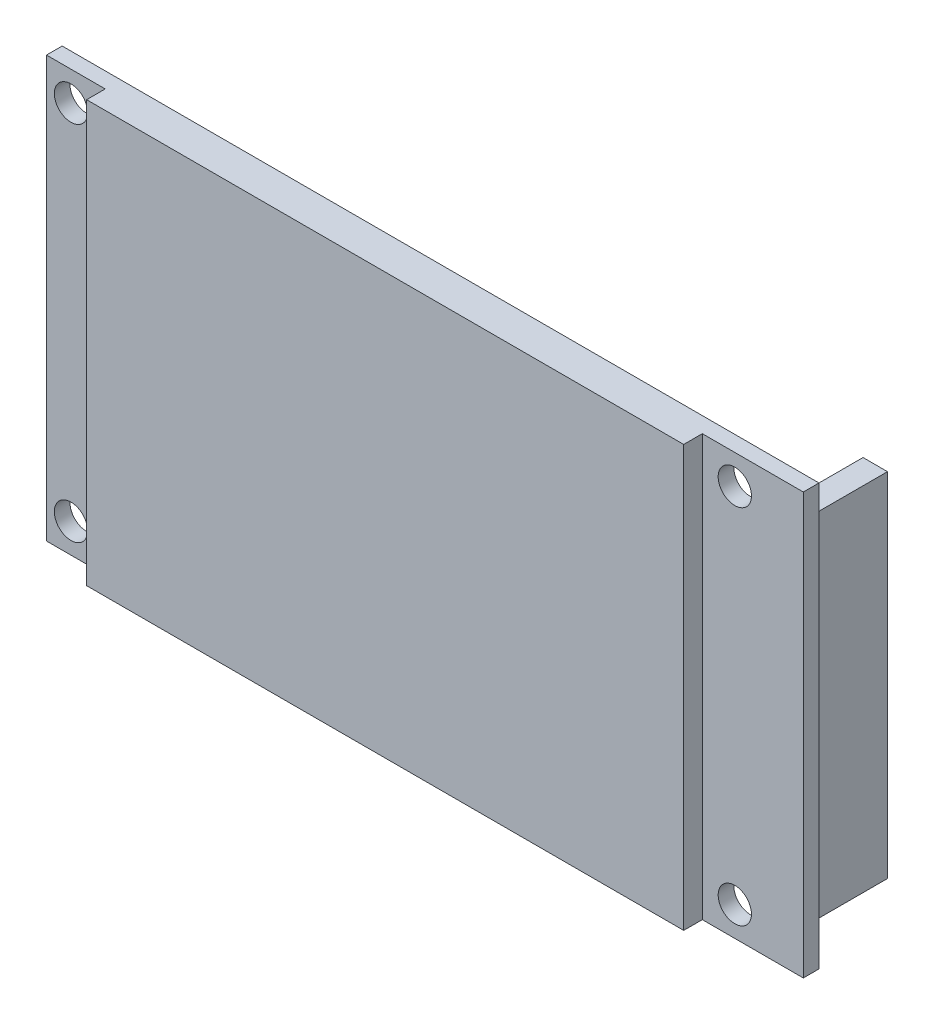
ISO-10303-21;
HEADER;
FILE_DESCRIPTION(('STEP AP214'),'2;1');
FILE_NAME('part.step','',(''),(''),'','','');
FILE_SCHEMA(('AUTOMOTIVE_DESIGN { 1 0 10303 214 1 1 1 1 }'));
ENDSEC;
DATA;
#1=APPLICATION_CONTEXT('core data for automotive mechanical design processes');
#2=APPLICATION_PROTOCOL_DEFINITION('international standard','automotive_design',2000,#1);
#3=PRODUCT_CONTEXT('',#1,'mechanical');
#4=PRODUCT('Part','Part','',(#3));
#5=PRODUCT_RELATED_PRODUCT_CATEGORY('part','',(#4));
#6=PRODUCT_DEFINITION_FORMATION('','',#4);
#7=PRODUCT_DEFINITION_CONTEXT('part definition',#1,'design');
#8=PRODUCT_DEFINITION('design','',#6,#7);
#9=PRODUCT_DEFINITION_SHAPE('','',#8);
#10=(LENGTH_UNIT() NAMED_UNIT(*) SI_UNIT(.MILLI.,.METRE.));
#11=(NAMED_UNIT(*) PLANE_ANGLE_UNIT() SI_UNIT($,.RADIAN.));
#12=(NAMED_UNIT(*) SI_UNIT($,.STERADIAN.) SOLID_ANGLE_UNIT());
#13=UNCERTAINTY_MEASURE_WITH_UNIT(LENGTH_MEASURE(1.E-05),#10,'distance_accuracy_value','');
#14=(GEOMETRIC_REPRESENTATION_CONTEXT(3) GLOBAL_UNCERTAINTY_ASSIGNED_CONTEXT((#13)) GLOBAL_UNIT_ASSIGNED_CONTEXT((#10,
#11,#12)) REPRESENTATION_CONTEXT('',''));
#15=CARTESIAN_POINT('',(0.,0.,0.));
#16=DIRECTION('',(0.,0.,1.));
#17=DIRECTION('',(1.,0.,0.));
#18=AXIS2_PLACEMENT_3D('',#15,#16,#17);
#19=CARTESIAN_POINT('',(0.,0.,0.));
#20=DIRECTION('',(0.,0.,-1.));
#21=DIRECTION('',(-1.,0.,0.));
#22=AXIS2_PLACEMENT_3D('',#19,#20,#21);
#23=PLANE('',#22);
#24=DIRECTION('',(0.,1.,0.));
#25=VECTOR('',#24,1.);
#26=CARTESIAN_POINT('',(77.32,0.,0.));
#27=LINE('',#26,#25);
#28=CARTESIAN_POINT('',(77.32,0.,0.));
#29=VERTEX_POINT('',#28);
#30=CARTESIAN_POINT('',(77.32,43.,0.));
#31=VERTEX_POINT('',#30);
#32=EDGE_CURVE('E276',#29,#31,#27,.T.);
#33=ORIENTED_EDGE('',*,*,#32,.F.);
#34=DIRECTION('',(1.,0.,0.));
#35=VECTOR('',#34,1.);
#36=CARTESIAN_POINT('',(0.,0.,0.));
#37=LINE('',#36,#35);
#38=CARTESIAN_POINT('',(0.,0.,0.));
#39=VERTEX_POINT('',#38);
#40=EDGE_CURVE('E274',#39,#29,#37,.T.);
#41=ORIENTED_EDGE('',*,*,#40,.F.);
#42=DIRECTION('',(0.,-1.,0.));
#43=VECTOR('',#42,1.);
#44=CARTESIAN_POINT('',(0.,0.,0.));
#45=LINE('',#44,#43);
#46=CARTESIAN_POINT('',(0.,43.,0.));
#47=VERTEX_POINT('',#46);
#48=EDGE_CURVE('E256',#47,#39,#45,.T.);
#49=ORIENTED_EDGE('',*,*,#48,.F.);
#50=DIRECTION('',(-1.,0.,0.));
#51=VECTOR('',#50,1.);
#52=CARTESIAN_POINT('',(0.,43.,0.));
#53=LINE('',#52,#51);
#54=EDGE_CURVE('E263',#31,#47,#53,.T.);
#55=ORIENTED_EDGE('',*,*,#54,.F.);
#56=EDGE_LOOP('',(#33,#41,#49,#55));
#57=FACE_BOUND('',#56,.T.);
#58=CARTESIAN_POINT('',(70.32,40.,0.));
#59=DIRECTION('',(0.,0.,1.));
#60=DIRECTION('',(1.,0.,0.));
#61=AXIS2_PLACEMENT_3D('',#58,#59,#60);
#62=CIRCLE('',#61,1.7);
#63=CARTESIAN_POINT('',(72.02,40.,0.));
#64=VERTEX_POINT('',#63);
#65=EDGE_CURVE('E250',#64,#64,#62,.T.);
#66=ORIENTED_EDGE('',*,*,#65,.T.);
#67=EDGE_LOOP('',(#66));
#68=FACE_BOUND('',#67,.T.);
#69=CARTESIAN_POINT('',(70.32,3.,0.));
#70=DIRECTION('',(0.,0.,1.));
#71=DIRECTION('',(1.,0.,0.));
#72=AXIS2_PLACEMENT_3D('',#69,#70,#71);
#73=CIRCLE('',#72,1.7);
#74=CARTESIAN_POINT('',(72.02,3.,0.));
#75=VERTEX_POINT('',#74);
#76=EDGE_CURVE('E244',#75,#75,#73,.T.);
#77=ORIENTED_EDGE('',*,*,#76,.T.);
#78=EDGE_LOOP('',(#77));
#79=FACE_BOUND('',#78,.T.);
#80=CARTESIAN_POINT('',(2.5,40.,0.));
#81=DIRECTION('',(0.,0.,1.));
#82=DIRECTION('',(1.,0.,0.));
#83=AXIS2_PLACEMENT_3D('',#80,#81,#82);
#84=CIRCLE('',#83,1.7);
#85=CARTESIAN_POINT('',(4.2,40.,0.));
#86=VERTEX_POINT('',#85);
#87=EDGE_CURVE('E234',#86,#86,#84,.T.);
#88=ORIENTED_EDGE('',*,*,#87,.T.);
#89=EDGE_LOOP('',(#88));
#90=FACE_BOUND('',#89,.T.);
#91=CARTESIAN_POINT('',(2.5,3.,0.));
#92=DIRECTION('',(0.,0.,1.));
#93=DIRECTION('',(1.,0.,0.));
#94=AXIS2_PLACEMENT_3D('',#91,#92,#93);
#95=CIRCLE('',#94,1.7);
#96=CARTESIAN_POINT('',(4.2,3.,0.));
#97=VERTEX_POINT('',#96);
#98=EDGE_CURVE('E238',#97,#97,#95,.T.);
#99=ORIENTED_EDGE('',*,*,#98,.T.);
#100=EDGE_LOOP('',(#99));
#101=FACE_BOUND('',#100,.T.);
#102=DIRECTION('',(-1.,0.,0.));
#103=VECTOR('',#102,1.);
#104=CARTESIAN_POINT('',(76.32,3.49999999999999,0.));
#105=LINE('',#104,#103);
#106=CARTESIAN_POINT('',(76.32,3.49999999999999,0.));
#107=VERTEX_POINT('',#106);
#108=CARTESIAN_POINT('',(73.82,3.49999999999999,0.));
#109=VERTEX_POINT('',#108);
#110=EDGE_CURVE('E177',#107,#109,#105,.T.);
#111=ORIENTED_EDGE('',*,*,#110,.F.);
#112=DIRECTION('',(0.,-1.,0.));
#113=VECTOR('',#112,1.);
#114=CARTESIAN_POINT('',(76.32,39.5,0.));
#115=LINE('',#114,#113);
#116=CARTESIAN_POINT('',(76.32,39.5,0.));
#117=VERTEX_POINT('',#116);
#118=EDGE_CURVE('E174',#117,#107,#115,.T.);
#119=ORIENTED_EDGE('',*,*,#118,.F.);
#120=DIRECTION('',(1.,0.,0.));
#121=VECTOR('',#120,1.);
#122=CARTESIAN_POINT('',(76.32,39.5,0.));
#123=LINE('',#122,#121);
#124=CARTESIAN_POINT('',(73.82,39.5,0.));
#125=VERTEX_POINT('',#124);
#126=EDGE_CURVE('E186',#125,#117,#123,.T.);
#127=ORIENTED_EDGE('',*,*,#126,.F.);
#128=DIRECTION('',(0.,1.,0.));
#129=VECTOR('',#128,1.);
#130=CARTESIAN_POINT('',(73.82,39.5,0.));
#131=LINE('',#130,#129);
#132=EDGE_CURVE('E194',#109,#125,#131,.T.);
#133=ORIENTED_EDGE('',*,*,#132,.F.);
#134=EDGE_LOOP('',(#111,#119,#127,#133));
#135=FACE_BOUND('',#134,.T.);
#136=DIRECTION('',(-1.,0.,0.));
#137=VECTOR('',#136,1.);
#138=CARTESIAN_POINT('',(3.5,16.,0.));
#139=LINE('',#138,#137);
#140=CARTESIAN_POINT('',(3.5,16.,0.));
#141=VERTEX_POINT('',#140);
#142=CARTESIAN_POINT('',(0.999999999999999,16.,0.));
#143=VERTEX_POINT('',#142);
#144=EDGE_CURVE('E347',#141,#143,#139,.T.);
#145=ORIENTED_EDGE('',*,*,#144,.F.);
#146=DIRECTION('',(0.,-1.,0.));
#147=VECTOR('',#146,1.);
#148=CARTESIAN_POINT('',(3.5,27.,0.));
#149=LINE('',#148,#147);
#150=CARTESIAN_POINT('',(3.5,27.,0.));
#151=VERTEX_POINT('',#150);
#152=EDGE_CURVE('E172',#151,#141,#149,.T.);
#153=ORIENTED_EDGE('',*,*,#152,.F.);
#154=DIRECTION('',(1.,0.,0.));
#155=VECTOR('',#154,1.);
#156=CARTESIAN_POINT('',(3.5,27.,0.));
#157=LINE('',#156,#155);
#158=CARTESIAN_POINT('',(1.,27.,0.));
#159=VERTEX_POINT('',#158);
#160=EDGE_CURVE('E168',#159,#151,#157,.T.);
#161=ORIENTED_EDGE('',*,*,#160,.F.);
#162=DIRECTION('',(0.,1.,0.));
#163=VECTOR('',#162,1.);
#164=CARTESIAN_POINT('',(1.,27.,0.));
#165=LINE('',#164,#163);
#166=EDGE_CURVE('E349',#143,#159,#165,.T.);
#167=ORIENTED_EDGE('',*,*,#166,.F.);
#168=EDGE_LOOP('',(#145,#153,#161,#167));
#169=FACE_BOUND('',#168,.T.);
#170=ADVANCED_FACE('F35',(#57,#68,#79,#90,#101,#135,#169),#23,.T.);
#171=CARTESIAN_POINT('',(0.,0.,1.6));
#172=DIRECTION('',(0.,0.,-1.));
#173=DIRECTION('',(-1.,0.,0.));
#174=AXIS2_PLACEMENT_3D('',#171,#172,#173);
#175=PLANE('',#174);
#176=CARTESIAN_POINT('',(2.5,40.,1.6));
#177=DIRECTION('',(0.,0.,1.));
#178=DIRECTION('',(1.,0.,0.));
#179=AXIS2_PLACEMENT_3D('',#176,#177,#178);
#180=CIRCLE('',#179,1.7);
#181=CARTESIAN_POINT('',(4.2,40.,1.6));
#182=VERTEX_POINT('',#181);
#183=EDGE_CURVE('E235',#182,#182,#180,.T.);
#184=ORIENTED_EDGE('',*,*,#183,.F.);
#185=EDGE_LOOP('',(#184));
#186=FACE_BOUND('',#185,.T.);
#187=CARTESIAN_POINT('',(2.5,3.,1.6));
#188=DIRECTION('',(0.,0.,1.));
#189=DIRECTION('',(1.,0.,0.));
#190=AXIS2_PLACEMENT_3D('',#187,#188,#189);
#191=CIRCLE('',#190,1.7);
#192=CARTESIAN_POINT('',(4.2,3.,1.6));
#193=VERTEX_POINT('',#192);
#194=EDGE_CURVE('E241',#193,#193,#191,.T.);
#195=ORIENTED_EDGE('',*,*,#194,.F.);
#196=EDGE_LOOP('',(#195));
#197=FACE_BOUND('',#196,.T.);
#198=DIRECTION('',(1.,0.,0.));
#199=VECTOR('',#198,1.);
#200=CARTESIAN_POINT('',(0.,0.,1.6));
#201=LINE('',#200,#199);
#202=CARTESIAN_POINT('',(0.,0.,1.6));
#203=VERTEX_POINT('',#202);
#204=CARTESIAN_POINT('',(6.,0.,1.6));
#205=VERTEX_POINT('',#204);
#206=EDGE_CURVE('E264',#203,#205,#201,.T.);
#207=ORIENTED_EDGE('',*,*,#206,.T.);
#208=DIRECTION('',(0.,1.,0.));
#209=VECTOR('',#208,1.);
#210=CARTESIAN_POINT('',(6.,0.,1.6));
#211=LINE('',#210,#209);
#212=CARTESIAN_POINT('',(6.,43.,1.6));
#213=VERTEX_POINT('',#212);
#214=EDGE_CURVE('E231',#205,#213,#211,.T.);
#215=ORIENTED_EDGE('',*,*,#214,.T.);
#216=DIRECTION('',(-1.,0.,0.));
#217=VECTOR('',#216,1.);
#218=CARTESIAN_POINT('',(0.,43.,1.6));
#219=LINE('',#218,#217);
#220=CARTESIAN_POINT('',(0.,43.,1.6));
#221=VERTEX_POINT('',#220);
#222=EDGE_CURVE('E268',#213,#221,#219,.T.);
#223=ORIENTED_EDGE('',*,*,#222,.T.);
#224=DIRECTION('',(0.,-1.,0.));
#225=VECTOR('',#224,1.);
#226=CARTESIAN_POINT('',(0.,0.,1.6));
#227=LINE('',#226,#225);
#228=EDGE_CURVE('E259',#221,#203,#227,.T.);
#229=ORIENTED_EDGE('',*,*,#228,.T.);
#230=EDGE_LOOP('',(#207,#215,#223,#229));
#231=FACE_BOUND('',#230,.T.);
#232=ADVANCED_FACE('F304',(#186,#197,#231),#175,.F.);
#233=CARTESIAN_POINT('',(77.32,43.,1.6));
#234=VERTEX_POINT('',#233);
#235=CARTESIAN_POINT('',(67.,43.,1.6));
#236=VERTEX_POINT('',#235);
#237=EDGE_CURVE('E269',#234,#236,#219,.T.);
#238=ORIENTED_EDGE('',*,*,#237,.T.);
#239=DIRECTION('',(0.,-1.,0.));
#240=VECTOR('',#239,1.);
#241=CARTESIAN_POINT('',(67.,0.,1.6));
#242=LINE('',#241,#240);
#243=CARTESIAN_POINT('',(67.,0.,1.6));
#244=VERTEX_POINT('',#243);
#245=EDGE_CURVE('E221',#236,#244,#242,.T.);
#246=ORIENTED_EDGE('',*,*,#245,.T.);
#247=CARTESIAN_POINT('',(77.32,0.,1.6));
#248=VERTEX_POINT('',#247);
#249=EDGE_CURVE('E262',#244,#248,#201,.T.);
#250=ORIENTED_EDGE('',*,*,#249,.T.);
#251=DIRECTION('',(0.,1.,0.));
#252=VECTOR('',#251,1.);
#253=CARTESIAN_POINT('',(77.32,0.,1.6));
#254=LINE('',#253,#252);
#255=EDGE_CURVE('E266',#248,#234,#254,.T.);
#256=ORIENTED_EDGE('',*,*,#255,.T.);
#257=EDGE_LOOP('',(#238,#246,#250,#256));
#258=FACE_BOUND('',#257,.T.);
#259=CARTESIAN_POINT('',(70.32,40.,1.6));
#260=DIRECTION('',(0.,0.,1.));
#261=DIRECTION('',(1.,0.,0.));
#262=AXIS2_PLACEMENT_3D('',#259,#260,#261);
#263=CIRCLE('',#262,1.7);
#264=CARTESIAN_POINT('',(72.02,40.,1.6));
#265=VERTEX_POINT('',#264);
#266=EDGE_CURVE('E253',#265,#265,#263,.T.);
#267=ORIENTED_EDGE('',*,*,#266,.F.);
#268=EDGE_LOOP('',(#267));
#269=FACE_BOUND('',#268,.T.);
#270=CARTESIAN_POINT('',(70.32,3.,1.6));
#271=DIRECTION('',(0.,0.,1.));
#272=DIRECTION('',(1.,0.,0.));
#273=AXIS2_PLACEMENT_3D('',#270,#271,#272);
#274=CIRCLE('',#273,1.7);
#275=CARTESIAN_POINT('',(72.02,3.,1.6));
#276=VERTEX_POINT('',#275);
#277=EDGE_CURVE('E247',#276,#276,#274,.T.);
#278=ORIENTED_EDGE('',*,*,#277,.F.);
#279=EDGE_LOOP('',(#278));
#280=FACE_BOUND('',#279,.T.);
#281=ADVANCED_FACE('F319',(#258,#269,#280),#175,.F.);
#282=CARTESIAN_POINT('',(0.,0.,1.6));
#283=DIRECTION('',(1.,0.,0.));
#284=DIRECTION('',(0.,0.,-1.));
#285=AXIS2_PLACEMENT_3D('',#282,#283,#284);
#286=PLANE('',#285);
#287=ORIENTED_EDGE('',*,*,#48,.T.);
#288=DIRECTION('',(0.,0.,-1.));
#289=VECTOR('',#288,1.);
#290=CARTESIAN_POINT('',(0.,0.,1.6));
#291=LINE('',#290,#289);
#292=EDGE_CURVE('E11',#203,#39,#291,.T.);
#293=ORIENTED_EDGE('',*,*,#292,.F.);
#294=ORIENTED_EDGE('',*,*,#228,.F.);
#295=DIRECTION('',(0.,0.,-1.));
#296=VECTOR('',#295,1.);
#297=CARTESIAN_POINT('',(0.,43.,1.6));
#298=LINE('',#297,#296);
#299=EDGE_CURVE('E271',#221,#47,#298,.T.);
#300=ORIENTED_EDGE('',*,*,#299,.T.);
#301=EDGE_LOOP('',(#287,#293,#294,#300));
#302=FACE_BOUND('',#301,.T.);
#303=ADVANCED_FACE('F37',(#302),#286,.F.);
#304=CARTESIAN_POINT('',(0.,0.,1.6));
#305=DIRECTION('',(0.,1.,0.));
#306=DIRECTION('',(0.,0.,1.));
#307=AXIS2_PLACEMENT_3D('',#304,#305,#306);
#308=PLANE('',#307);
#309=ORIENTED_EDGE('',*,*,#249,.F.);
#310=DIRECTION('',(0.,0.,-1.));
#311=VECTOR('',#310,1.);
#312=CARTESIAN_POINT('',(67.,0.,3.5));
#313=LINE('',#312,#311);
#314=CARTESIAN_POINT('',(67.,0.,3.5));
#315=VERTEX_POINT('',#314);
#316=EDGE_CURVE('E222',#315,#244,#313,.T.);
#317=ORIENTED_EDGE('',*,*,#316,.F.);
#318=DIRECTION('',(-1.,0.,0.));
#319=VECTOR('',#318,1.);
#320=CARTESIAN_POINT('',(6.,0.,3.5));
#321=LINE('',#320,#319);
#322=CARTESIAN_POINT('',(6.,0.,3.5));
#323=VERTEX_POINT('',#322);
#324=EDGE_CURVE('E214',#315,#323,#321,.T.);
#325=ORIENTED_EDGE('',*,*,#324,.T.);
#326=DIRECTION('',(0.,0.,-1.));
#327=VECTOR('',#326,1.);
#328=CARTESIAN_POINT('',(6.,0.,3.5));
#329=LINE('',#328,#327);
#330=EDGE_CURVE('E218',#323,#205,#329,.T.);
#331=ORIENTED_EDGE('',*,*,#330,.T.);
#332=ORIENTED_EDGE('',*,*,#206,.F.);
#333=ORIENTED_EDGE('',*,*,#292,.T.);
#334=ORIENTED_EDGE('',*,*,#40,.T.);
#335=DIRECTION('',(0.,0.,-1.));
#336=VECTOR('',#335,1.);
#337=CARTESIAN_POINT('',(77.32,0.,1.6));
#338=LINE('',#337,#336);
#339=EDGE_CURVE('E43',#248,#29,#338,.T.);
#340=ORIENTED_EDGE('',*,*,#339,.F.);
#341=EDGE_LOOP('',(#309,#317,#325,#331,#332,#333,#334,#340));
#342=FACE_BOUND('',#341,.T.);
#343=ADVANCED_FACE('F314',(#342),#308,.F.);
#344=CARTESIAN_POINT('',(77.32,0.,1.6));
#345=DIRECTION('',(-1.,0.,0.));
#346=DIRECTION('',(0.,0.,1.));
#347=AXIS2_PLACEMENT_3D('',#344,#345,#346);
#348=PLANE('',#347);
#349=ORIENTED_EDGE('',*,*,#32,.T.);
#350=DIRECTION('',(0.,0.,-1.));
#351=VECTOR('',#350,1.);
#352=CARTESIAN_POINT('',(77.32,43.,1.6));
#353=LINE('',#352,#351);
#354=EDGE_CURVE('E281',#234,#31,#353,.T.);
#355=ORIENTED_EDGE('',*,*,#354,.F.);
#356=ORIENTED_EDGE('',*,*,#255,.F.);
#357=ORIENTED_EDGE('',*,*,#339,.T.);
#358=EDGE_LOOP('',(#349,#355,#356,#357));
#359=FACE_BOUND('',#358,.T.);
#360=ADVANCED_FACE('F288',(#359),#348,.F.);
#361=CARTESIAN_POINT('',(0.,43.,1.6));
#362=DIRECTION('',(0.,-1.,0.));
#363=DIRECTION('',(0.,0.,-1.));
#364=AXIS2_PLACEMENT_3D('',#361,#362,#363);
#365=PLANE('',#364);
#366=ORIENTED_EDGE('',*,*,#54,.T.);
#367=ORIENTED_EDGE('',*,*,#299,.F.);
#368=ORIENTED_EDGE('',*,*,#222,.F.);
#369=DIRECTION('',(0.,0.,-1.));
#370=VECTOR('',#369,1.);
#371=CARTESIAN_POINT('',(6.,43.,3.5));
#372=LINE('',#371,#370);
#373=CARTESIAN_POINT('',(6.,43.,3.5));
#374=VERTEX_POINT('',#373);
#375=EDGE_CURVE('E217',#374,#213,#372,.T.);
#376=ORIENTED_EDGE('',*,*,#375,.F.);
#377=DIRECTION('',(1.,0.,0.));
#378=VECTOR('',#377,1.);
#379=CARTESIAN_POINT('',(6.,43.,3.5));
#380=LINE('',#379,#378);
#381=CARTESIAN_POINT('',(67.,43.,3.5));
#382=VERTEX_POINT('',#381);
#383=EDGE_CURVE('E208',#374,#382,#380,.T.);
#384=ORIENTED_EDGE('',*,*,#383,.T.);
#385=DIRECTION('',(0.,0.,-1.));
#386=VECTOR('',#385,1.);
#387=CARTESIAN_POINT('',(67.,43.,3.5));
#388=LINE('',#387,#386);
#389=EDGE_CURVE('E225',#382,#236,#388,.T.);
#390=ORIENTED_EDGE('',*,*,#389,.T.);
#391=ORIENTED_EDGE('',*,*,#237,.F.);
#392=ORIENTED_EDGE('',*,*,#354,.T.);
#393=EDGE_LOOP('',(#366,#367,#368,#376,#384,#390,#391,#392));
#394=FACE_BOUND('',#393,.T.);
#395=ADVANCED_FACE('F298',(#394),#365,.F.);
#396=CARTESIAN_POINT('',(70.32,40.,1.6));
#397=DIRECTION('',(0.,0.,-1.));
#398=DIRECTION('',(-1.,0.,0.));
#399=AXIS2_PLACEMENT_3D('',#396,#397,#398);
#400=CYLINDRICAL_SURFACE('',#399,1.7);
#401=ORIENTED_EDGE('',*,*,#266,.T.);
#402=EDGE_LOOP('',(#401));
#403=FACE_BOUND('',#402,.T.);
#404=ORIENTED_EDGE('',*,*,#65,.F.);
#405=EDGE_LOOP('',(#404));
#406=FACE_BOUND('',#405,.T.);
#407=ADVANCED_FACE('F331',(#403,#406),#400,.F.);
#408=CARTESIAN_POINT('',(70.32,3.,1.6));
#409=DIRECTION('',(0.,0.,-1.));
#410=DIRECTION('',(-1.,0.,0.));
#411=AXIS2_PLACEMENT_3D('',#408,#409,#410);
#412=CYLINDRICAL_SURFACE('',#411,1.7);
#413=ORIENTED_EDGE('',*,*,#277,.T.);
#414=EDGE_LOOP('',(#413));
#415=FACE_BOUND('',#414,.T.);
#416=ORIENTED_EDGE('',*,*,#76,.F.);
#417=EDGE_LOOP('',(#416));
#418=FACE_BOUND('',#417,.T.);
#419=ADVANCED_FACE('F327',(#415,#418),#412,.F.);
#420=CARTESIAN_POINT('',(2.5,3.,1.6));
#421=DIRECTION('',(0.,0.,-1.));
#422=DIRECTION('',(-1.,0.,0.));
#423=AXIS2_PLACEMENT_3D('',#420,#421,#422);
#424=CYLINDRICAL_SURFACE('',#423,1.7);
#425=ORIENTED_EDGE('',*,*,#194,.T.);
#426=EDGE_LOOP('',(#425));
#427=FACE_BOUND('',#426,.T.);
#428=ORIENTED_EDGE('',*,*,#98,.F.);
#429=EDGE_LOOP('',(#428));
#430=FACE_BOUND('',#429,.T.);
#431=ADVANCED_FACE('F330',(#427,#430),#424,.F.);
#432=CARTESIAN_POINT('',(2.5,40.,1.6));
#433=DIRECTION('',(0.,0.,-1.));
#434=DIRECTION('',(-1.,0.,0.));
#435=AXIS2_PLACEMENT_3D('',#432,#433,#434);
#436=CYLINDRICAL_SURFACE('',#435,1.7);
#437=ORIENTED_EDGE('',*,*,#183,.T.);
#438=EDGE_LOOP('',(#437));
#439=FACE_BOUND('',#438,.T.);
#440=ORIENTED_EDGE('',*,*,#87,.F.);
#441=EDGE_LOOP('',(#440));
#442=FACE_BOUND('',#441,.T.);
#443=ADVANCED_FACE('F399',(#439,#442),#436,.F.);
#444=CARTESIAN_POINT('',(6.,0.,3.5));
#445=DIRECTION('',(-1.,0.,0.));
#446=DIRECTION('',(0.,0.,1.));
#447=AXIS2_PLACEMENT_3D('',#444,#445,#446);
#448=PLANE('',#447);
#449=ORIENTED_EDGE('',*,*,#214,.F.);
#450=ORIENTED_EDGE('',*,*,#330,.F.);
#451=DIRECTION('',(0.,1.,0.));
#452=VECTOR('',#451,1.);
#453=CARTESIAN_POINT('',(6.,0.,3.5));
#454=LINE('',#453,#452);
#455=EDGE_CURVE('E205',#323,#374,#454,.T.);
#456=ORIENTED_EDGE('',*,*,#455,.T.);
#457=ORIENTED_EDGE('',*,*,#375,.T.);
#458=EDGE_LOOP('',(#449,#450,#456,#457));
#459=FACE_BOUND('',#458,.T.);
#460=ADVANCED_FACE('F313',(#459),#448,.T.);
#461=CARTESIAN_POINT('',(67.,0.,3.5));
#462=DIRECTION('',(1.,0.,0.));
#463=DIRECTION('',(0.,0.,-1.));
#464=AXIS2_PLACEMENT_3D('',#461,#462,#463);
#465=PLANE('',#464);
#466=ORIENTED_EDGE('',*,*,#245,.F.);
#467=ORIENTED_EDGE('',*,*,#389,.F.);
#468=DIRECTION('',(0.,-1.,0.));
#469=VECTOR('',#468,1.);
#470=CARTESIAN_POINT('',(67.,0.,3.5));
#471=LINE('',#470,#469);
#472=EDGE_CURVE('E211',#382,#315,#471,.T.);
#473=ORIENTED_EDGE('',*,*,#472,.T.);
#474=ORIENTED_EDGE('',*,*,#316,.T.);
#475=EDGE_LOOP('',(#466,#467,#473,#474));
#476=FACE_BOUND('',#475,.T.);
#477=ADVANCED_FACE('F317',(#476),#465,.T.);
#478=CARTESIAN_POINT('',(0.,0.,3.5));
#479=DIRECTION('',(0.,0.,-1.));
#480=DIRECTION('',(-1.,0.,0.));
#481=AXIS2_PLACEMENT_3D('',#478,#479,#480);
#482=PLANE('',#481);
#483=ORIENTED_EDGE('',*,*,#455,.F.);
#484=ORIENTED_EDGE('',*,*,#324,.F.);
#485=ORIENTED_EDGE('',*,*,#472,.F.);
#486=ORIENTED_EDGE('',*,*,#383,.F.);
#487=EDGE_LOOP('',(#483,#484,#485,#486));
#488=FACE_BOUND('',#487,.T.);
#489=ADVANCED_FACE('F311',(#488),#482,.F.);
#490=CARTESIAN_POINT('',(76.32,39.5,-8.));
#491=DIRECTION('',(-1.,0.,0.));
#492=DIRECTION('',(0.,0.,1.));
#493=AXIS2_PLACEMENT_3D('',#490,#491,#492);
#494=PLANE('',#493);
#495=ORIENTED_EDGE('',*,*,#118,.T.);
#496=DIRECTION('',(0.,0.,1.));
#497=VECTOR('',#496,1.);
#498=CARTESIAN_POINT('',(76.32,3.49999999999999,-8.));
#499=LINE('',#498,#497);
#500=CARTESIAN_POINT('',(76.32,3.49999999999999,-8.));
#501=VERTEX_POINT('',#500);
#502=EDGE_CURVE('E203',#501,#107,#499,.T.);
#503=ORIENTED_EDGE('',*,*,#502,.F.);
#504=DIRECTION('',(0.,-1.,0.));
#505=VECTOR('',#504,1.);
#506=CARTESIAN_POINT('',(76.32,39.5,-8.));
#507=LINE('',#506,#505);
#508=CARTESIAN_POINT('',(76.32,39.5,-8.));
#509=VERTEX_POINT('',#508);
#510=EDGE_CURVE('E182',#509,#501,#507,.T.);
#511=ORIENTED_EDGE('',*,*,#510,.F.);
#512=DIRECTION('',(0.,0.,1.));
#513=VECTOR('',#512,1.);
#514=CARTESIAN_POINT('',(76.32,39.5,-8.));
#515=LINE('',#514,#513);
#516=EDGE_CURVE('E191',#509,#117,#515,.T.);
#517=ORIENTED_EDGE('',*,*,#516,.T.);
#518=EDGE_LOOP('',(#495,#503,#511,#517));
#519=FACE_BOUND('',#518,.T.);
#520=ADVANCED_FACE('F388',(#519),#494,.F.);
#521=CARTESIAN_POINT('',(76.32,3.49999999999999,-8.));
#522=DIRECTION('',(0.,1.,0.));
#523=DIRECTION('',(0.,0.,1.));
#524=AXIS2_PLACEMENT_3D('',#521,#522,#523);
#525=PLANE('',#524);
#526=ORIENTED_EDGE('',*,*,#110,.T.);
#527=DIRECTION('',(0.,0.,1.));
#528=VECTOR('',#527,1.);
#529=CARTESIAN_POINT('',(73.82,3.49999999999999,-8.));
#530=LINE('',#529,#528);
#531=CARTESIAN_POINT('',(73.82,3.49999999999999,-8.));
#532=VERTEX_POINT('',#531);
#533=EDGE_CURVE('E200',#532,#109,#530,.T.);
#534=ORIENTED_EDGE('',*,*,#533,.F.);
#535=DIRECTION('',(-1.,0.,0.));
#536=VECTOR('',#535,1.);
#537=CARTESIAN_POINT('',(76.32,3.49999999999999,-8.));
#538=LINE('',#537,#536);
#539=EDGE_CURVE('E185',#501,#532,#538,.T.);
#540=ORIENTED_EDGE('',*,*,#539,.F.);
#541=ORIENTED_EDGE('',*,*,#502,.T.);
#542=EDGE_LOOP('',(#526,#534,#540,#541));
#543=FACE_BOUND('',#542,.T.);
#544=ADVANCED_FACE('F384',(#543),#525,.F.);
#545=CARTESIAN_POINT('',(73.82,39.5,-8.));
#546=DIRECTION('',(1.,0.,0.));
#547=DIRECTION('',(0.,0.,-1.));
#548=AXIS2_PLACEMENT_3D('',#545,#546,#547);
#549=PLANE('',#548);
#550=ORIENTED_EDGE('',*,*,#132,.T.);
#551=DIRECTION('',(0.,0.,1.));
#552=VECTOR('',#551,1.);
#553=CARTESIAN_POINT('',(73.82,39.5,-8.));
#554=LINE('',#553,#552);
#555=CARTESIAN_POINT('',(73.82,39.5,-8.));
#556=VERTEX_POINT('',#555);
#557=EDGE_CURVE('E58',#556,#125,#554,.T.);
#558=ORIENTED_EDGE('',*,*,#557,.F.);
#559=DIRECTION('',(0.,1.,0.));
#560=VECTOR('',#559,1.);
#561=CARTESIAN_POINT('',(73.82,39.5,-8.));
#562=LINE('',#561,#560);
#563=EDGE_CURVE('E188',#532,#556,#562,.T.);
#564=ORIENTED_EDGE('',*,*,#563,.F.);
#565=ORIENTED_EDGE('',*,*,#533,.T.);
#566=EDGE_LOOP('',(#550,#558,#564,#565));
#567=FACE_BOUND('',#566,.T.);
#568=ADVANCED_FACE('F381',(#567),#549,.F.);
#569=CARTESIAN_POINT('',(76.32,39.5,-8.));
#570=DIRECTION('',(0.,-1.,0.));
#571=DIRECTION('',(1.,0.,0.));
#572=AXIS2_PLACEMENT_3D('',#569,#570,#571);
#573=PLANE('',#572);
#574=ORIENTED_EDGE('',*,*,#126,.T.);
#575=ORIENTED_EDGE('',*,*,#516,.F.);
#576=DIRECTION('',(1.,0.,0.));
#577=VECTOR('',#576,1.);
#578=CARTESIAN_POINT('',(76.32,39.5,-8.));
#579=LINE('',#578,#577);
#580=EDGE_CURVE('E190',#556,#509,#579,.T.);
#581=ORIENTED_EDGE('',*,*,#580,.F.);
#582=ORIENTED_EDGE('',*,*,#557,.T.);
#583=EDGE_LOOP('',(#574,#575,#581,#582));
#584=FACE_BOUND('',#583,.T.);
#585=ADVANCED_FACE('F377',(#584),#573,.F.);
#586=CARTESIAN_POINT('',(0.,0.,-8.));
#587=DIRECTION('',(0.,0.,-1.));
#588=DIRECTION('',(-1.,0.,0.));
#589=AXIS2_PLACEMENT_3D('',#586,#587,#588);
#590=PLANE('',#589);
#591=ORIENTED_EDGE('',*,*,#510,.T.);
#592=ORIENTED_EDGE('',*,*,#539,.T.);
#593=ORIENTED_EDGE('',*,*,#563,.T.);
#594=ORIENTED_EDGE('',*,*,#580,.T.);
#595=EDGE_LOOP('',(#591,#592,#593,#594));
#596=FACE_BOUND('',#595,.T.);
#597=ADVANCED_FACE('F374',(#596),#590,.T.);
#598=CARTESIAN_POINT('',(3.5,27.,-8.));
#599=DIRECTION('',(-1.,0.,0.));
#600=DIRECTION('',(0.,-1.,0.));
#601=AXIS2_PLACEMENT_3D('',#598,#599,#600);
#602=PLANE('',#601);
#603=ORIENTED_EDGE('',*,*,#152,.T.);
#604=DIRECTION('',(0.,0.,1.));
#605=VECTOR('',#604,1.);
#606=CARTESIAN_POINT('',(3.5,16.,-8.));
#607=LINE('',#606,#605);
#608=CARTESIAN_POINT('',(3.5,16.,-8.));
#609=VERTEX_POINT('',#608);
#610=EDGE_CURVE('E153',#609,#141,#607,.T.);
#611=ORIENTED_EDGE('',*,*,#610,.F.);
#612=DIRECTION('',(0.,-1.,0.));
#613=VECTOR('',#612,1.);
#614=CARTESIAN_POINT('',(3.5,27.,-8.));
#615=LINE('',#614,#613);
#616=CARTESIAN_POINT('',(3.5,27.,-8.));
#617=VERTEX_POINT('',#616);
#618=EDGE_CURVE('E160',#617,#609,#615,.T.);
#619=ORIENTED_EDGE('',*,*,#618,.F.);
#620=DIRECTION('',(0.,0.,1.));
#621=VECTOR('',#620,1.);
#622=CARTESIAN_POINT('',(3.5,27.,-8.));
#623=LINE('',#622,#621);
#624=EDGE_CURVE('E356',#617,#151,#623,.T.);
#625=ORIENTED_EDGE('',*,*,#624,.T.);
#626=EDGE_LOOP('',(#603,#611,#619,#625));
#627=FACE_BOUND('',#626,.T.);
#628=ADVANCED_FACE('F170',(#627),#602,.F.);
#629=CARTESIAN_POINT('',(3.5,16.,-8.));
#630=DIRECTION('',(0.,1.,0.));
#631=DIRECTION('',(0.,0.,1.));
#632=AXIS2_PLACEMENT_3D('',#629,#630,#631);
#633=PLANE('',#632);
#634=ORIENTED_EDGE('',*,*,#144,.T.);
#635=DIRECTION('',(0.,0.,1.));
#636=VECTOR('',#635,1.);
#637=CARTESIAN_POINT('',(0.999999999999999,16.,-8.));
#638=LINE('',#637,#636);
#639=CARTESIAN_POINT('',(0.999999999999999,16.,-8.));
#640=VERTEX_POINT('',#639);
#641=EDGE_CURVE('E156',#640,#143,#638,.T.);
#642=ORIENTED_EDGE('',*,*,#641,.F.);
#643=DIRECTION('',(-1.,0.,0.));
#644=VECTOR('',#643,1.);
#645=CARTESIAN_POINT('',(3.5,16.,-8.));
#646=LINE('',#645,#644);
#647=EDGE_CURVE('E149',#609,#640,#646,.T.);
#648=ORIENTED_EDGE('',*,*,#647,.F.);
#649=ORIENTED_EDGE('',*,*,#610,.T.);
#650=EDGE_LOOP('',(#634,#642,#648,#649));
#651=FACE_BOUND('',#650,.T.);
#652=ADVANCED_FACE('F151',(#651),#633,.F.);
#653=CARTESIAN_POINT('',(1.,27.,-8.));
#654=DIRECTION('',(1.,0.,0.));
#655=DIRECTION('',(0.,1.,0.));
#656=AXIS2_PLACEMENT_3D('',#653,#654,#655);
#657=PLANE('',#656);
#658=ORIENTED_EDGE('',*,*,#166,.T.);
#659=DIRECTION('',(0.,0.,1.));
#660=VECTOR('',#659,1.);
#661=CARTESIAN_POINT('',(1.,27.,-8.));
#662=LINE('',#661,#660);
#663=CARTESIAN_POINT('',(1.,27.,-8.));
#664=VERTEX_POINT('',#663);
#665=EDGE_CURVE('E50',#664,#159,#662,.T.);
#666=ORIENTED_EDGE('',*,*,#665,.F.);
#667=DIRECTION('',(0.,1.,0.));
#668=VECTOR('',#667,1.);
#669=CARTESIAN_POINT('',(1.,27.,-8.));
#670=LINE('',#669,#668);
#671=EDGE_CURVE('E159',#640,#664,#670,.T.);
#672=ORIENTED_EDGE('',*,*,#671,.F.);
#673=ORIENTED_EDGE('',*,*,#641,.T.);
#674=EDGE_LOOP('',(#658,#666,#672,#673));
#675=FACE_BOUND('',#674,.T.);
#676=ADVANCED_FACE('F359',(#675),#657,.F.);
#677=CARTESIAN_POINT('',(3.5,27.,-8.));
#678=DIRECTION('',(0.,-1.,0.));
#679=DIRECTION('',(0.,0.,-1.));
#680=AXIS2_PLACEMENT_3D('',#677,#678,#679);
#681=PLANE('',#680);
#682=ORIENTED_EDGE('',*,*,#160,.T.);
#683=ORIENTED_EDGE('',*,*,#624,.F.);
#684=DIRECTION('',(1.,0.,0.));
#685=VECTOR('',#684,1.);
#686=CARTESIAN_POINT('',(3.5,27.,-8.));
#687=LINE('',#686,#685);
#688=EDGE_CURVE('E164',#664,#617,#687,.T.);
#689=ORIENTED_EDGE('',*,*,#688,.F.);
#690=ORIENTED_EDGE('',*,*,#665,.T.);
#691=EDGE_LOOP('',(#682,#683,#689,#690));
#692=FACE_BOUND('',#691,.T.);
#693=ADVANCED_FACE('F360',(#692),#681,.F.);
#694=CARTESIAN_POINT('',(0.,0.,-8.));
#695=DIRECTION('',(0.,0.,-1.));
#696=DIRECTION('',(-1.,0.,0.));
#697=AXIS2_PLACEMENT_3D('',#694,#695,#696);
#698=PLANE('',#697);
#699=ORIENTED_EDGE('',*,*,#618,.T.);
#700=ORIENTED_EDGE('',*,*,#647,.T.);
#701=ORIENTED_EDGE('',*,*,#671,.T.);
#702=ORIENTED_EDGE('',*,*,#688,.T.);
#703=EDGE_LOOP('',(#699,#700,#701,#702));
#704=FACE_BOUND('',#703,.T.);
#705=ADVANCED_FACE('F163',(#704),#698,.T.);
#706=CLOSED_SHELL('',(#170,#232,#281,#303,#343,#360,#395,#407,#419,#431,#443,#460,#477,#489,
#520,#544,#568,#585,#597,#628,#652,#676,#693,#705));
#707=MANIFOLD_SOLID_BREP('B2',#706);
#708=ADVANCED_BREP_SHAPE_REPRESENTATION('',(#18,#707),#14);
#709=SHAPE_DEFINITION_REPRESENTATION(#9,#708);
ENDSEC;
END-ISO-10303-21;
